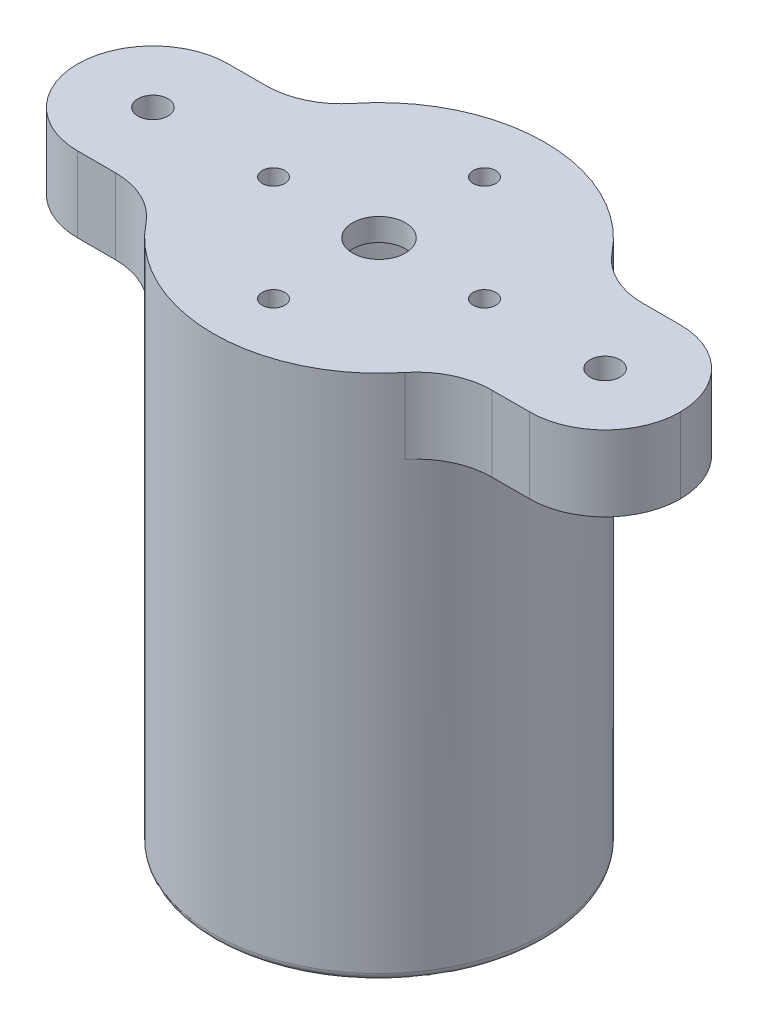
ISO-10303-21;
HEADER;
FILE_DESCRIPTION(('STEP AP214'),'2;1');
FILE_NAME('part.step','',(''),(''),'','','');
FILE_SCHEMA(('AUTOMOTIVE_DESIGN { 1 0 10303 214 1 1 1 1 }'));
ENDSEC;
DATA;
#1=APPLICATION_CONTEXT('core data for automotive mechanical design processes');
#2=APPLICATION_PROTOCOL_DEFINITION('international standard','automotive_design',2000,#1);
#3=PRODUCT_CONTEXT('',#1,'mechanical');
#4=PRODUCT('Part','Part','',(#3));
#5=PRODUCT_RELATED_PRODUCT_CATEGORY('part','',(#4));
#6=PRODUCT_DEFINITION_FORMATION('','',#4);
#7=PRODUCT_DEFINITION_CONTEXT('part definition',#1,'design');
#8=PRODUCT_DEFINITION('design','',#6,#7);
#9=PRODUCT_DEFINITION_SHAPE('','',#8);
#10=(LENGTH_UNIT() NAMED_UNIT(*) SI_UNIT(.MILLI.,.METRE.));
#11=(NAMED_UNIT(*) PLANE_ANGLE_UNIT() SI_UNIT($,.RADIAN.));
#12=(NAMED_UNIT(*) SI_UNIT($,.STERADIAN.) SOLID_ANGLE_UNIT());
#13=UNCERTAINTY_MEASURE_WITH_UNIT(LENGTH_MEASURE(1.E-05),#10,'distance_accuracy_value','');
#14=(GEOMETRIC_REPRESENTATION_CONTEXT(3) GLOBAL_UNCERTAINTY_ASSIGNED_CONTEXT((#13)) GLOBAL_UNIT_ASSIGNED_CONTEXT((#10,
#11,#12)) REPRESENTATION_CONTEXT('',''));
#15=CARTESIAN_POINT('',(0.,0.,0.));
#16=DIRECTION('',(0.,0.,1.));
#17=DIRECTION('',(1.,0.,0.));
#18=AXIS2_PLACEMENT_3D('',#15,#16,#17);
#19=CARTESIAN_POINT('',(0.,65.,0.));
#20=DIRECTION('',(0.,1.,0.));
#21=DIRECTION('',(0.,0.,1.));
#22=AXIS2_PLACEMENT_3D('',#19,#20,#21);
#23=CYLINDRICAL_SURFACE('',#22,3.5);
#24=CARTESIAN_POINT('',(0.,70.,0.));
#25=DIRECTION('',(0.,1.,0.));
#26=DIRECTION('',(0.,0.,1.));
#27=AXIS2_PLACEMENT_3D('',#24,#25,#26);
#28=CIRCLE('',#27,3.5);
#29=CARTESIAN_POINT('',(0.,70.,3.5));
#30=VERTEX_POINT('',#29);
#31=EDGE_CURVE('E258',#30,#30,#28,.T.);
#32=ORIENTED_EDGE('',*,*,#31,.T.);
#33=EDGE_LOOP('',(#32));
#34=FACE_BOUND('',#33,.T.);
#35=CARTESIAN_POINT('',(0.,67.,0.));
#36=DIRECTION('',(0.,-1.,0.));
#37=DIRECTION('',(0.,0.,-1.));
#38=AXIS2_PLACEMENT_3D('',#35,#36,#37);
#39=CIRCLE('',#38,3.5);
#40=CARTESIAN_POINT('',(0.,67.,-3.5));
#41=VERTEX_POINT('',#40);
#42=EDGE_CURVE('E42',#41,#41,#39,.F.);
#43=ORIENTED_EDGE('',*,*,#42,.F.);
#44=EDGE_LOOP('',(#43));
#45=FACE_BOUND('',#44,.T.);
#46=ADVANCED_FACE('F38',(#34,#45),#23,.F.);
#47=CARTESIAN_POINT('',(0.,70.,0.));
#48=DIRECTION('',(0.,-1.,0.));
#49=DIRECTION('',(0.,0.,-1.));
#50=AXIS2_PLACEMENT_3D('',#47,#48,#49);
#51=CYLINDRICAL_SURFACE('',#50,22.);
#52=CARTESIAN_POINT('',(0.,1.,0.));
#53=DIRECTION('',(0.,1.,0.));
#54=DIRECTION('',(0.,0.,1.));
#55=AXIS2_PLACEMENT_3D('',#52,#53,#54);
#56=CIRCLE('',#55,22.);
#57=CARTESIAN_POINT('',(0.,1.,22.));
#58=VERTEX_POINT('',#57);
#59=EDGE_CURVE('E11',#58,#58,#56,.T.);
#60=ORIENTED_EDGE('',*,*,#59,.T.);
#61=EDGE_LOOP('',(#60));
#62=FACE_BOUND('',#61,.T.);
#63=CARTESIAN_POINT('',(0.,70.,0.));
#64=DIRECTION('',(0.,1.,0.));
#65=DIRECTION('',(0.,0.,1.));
#66=AXIS2_PLACEMENT_3D('',#63,#64,#65);
#67=CIRCLE('',#66,22.);
#68=CARTESIAN_POINT('',(-17.1737444955956,70.,13.75));
#69=VERTEX_POINT('',#68);
#70=CARTESIAN_POINT('',(17.1737444955956,70.,13.75));
#71=VERTEX_POINT('',#70);
#72=EDGE_CURVE('E272',#69,#71,#67,.T.);
#73=ORIENTED_EDGE('',*,*,#72,.F.);
#74=DIRECTION('',(0.,-1.,0.));
#75=VECTOR('',#74,1.);
#76=CARTESIAN_POINT('',(-17.1737444955956,70.,13.75));
#77=LINE('',#76,#75);
#78=CARTESIAN_POINT('',(-17.1737444955956,60.,13.75));
#79=VERTEX_POINT('',#78);
#80=EDGE_CURVE('E202',#69,#79,#77,.T.);
#81=ORIENTED_EDGE('',*,*,#80,.T.);
#82=CARTESIAN_POINT('',(0.,60.,0.));
#83=DIRECTION('',(0.,1.,0.));
#84=DIRECTION('',(0.,0.,1.));
#85=AXIS2_PLACEMENT_3D('',#82,#83,#84);
#86=CIRCLE('',#85,22.);
#87=CARTESIAN_POINT('',(-17.1737444955956,60.,-13.75));
#88=VERTEX_POINT('',#87);
#89=EDGE_CURVE('E166',#88,#79,#86,.T.);
#90=ORIENTED_EDGE('',*,*,#89,.F.);
#91=DIRECTION('',(0.,-1.,0.));
#92=VECTOR('',#91,1.);
#93=CARTESIAN_POINT('',(-17.1737444955956,70.,-13.75));
#94=LINE('',#93,#92);
#95=CARTESIAN_POINT('',(-17.1737444955956,70.,-13.75));
#96=VERTEX_POINT('',#95);
#97=EDGE_CURVE('E199',#88,#96,#94,.F.);
#98=ORIENTED_EDGE('',*,*,#97,.T.);
#99=CARTESIAN_POINT('',(17.1737444955956,70.,-13.75));
#100=VERTEX_POINT('',#99);
#101=EDGE_CURVE('E275',#100,#96,#67,.T.);
#102=ORIENTED_EDGE('',*,*,#101,.F.);
#103=DIRECTION('',(0.,-1.,0.));
#104=VECTOR('',#103,1.);
#105=CARTESIAN_POINT('',(17.1737444955956,70.,-13.75));
#106=LINE('',#105,#104);
#107=CARTESIAN_POINT('',(17.1737444955956,60.,-13.75));
#108=VERTEX_POINT('',#107);
#109=EDGE_CURVE('E196',#100,#108,#106,.T.);
#110=ORIENTED_EDGE('',*,*,#109,.T.);
#111=CARTESIAN_POINT('',(17.1737444955956,60.,13.75));
#112=VERTEX_POINT('',#111);
#113=EDGE_CURVE('E162',#112,#108,#86,.T.);
#114=ORIENTED_EDGE('',*,*,#113,.F.);
#115=DIRECTION('',(0.,-1.,0.));
#116=VECTOR('',#115,1.);
#117=CARTESIAN_POINT('',(17.1737444955956,70.,13.75));
#118=LINE('',#117,#116);
#119=EDGE_CURVE('E191',#112,#71,#118,.F.);
#120=ORIENTED_EDGE('',*,*,#119,.T.);
#121=EDGE_LOOP('',(#73,#81,#90,#98,#102,#110,#114,#120));
#122=FACE_BOUND('',#121,.T.);
#123=ADVANCED_FACE('F281',(#62,#122),#51,.T.);
#124=CARTESIAN_POINT('',(0.,70.,0.));
#125=DIRECTION('',(0.,1.,0.));
#126=DIRECTION('',(0.,0.,1.));
#127=AXIS2_PLACEMENT_3D('',#124,#125,#126);
#128=PLANE('',#127);
#129=CARTESIAN_POINT('',(30.,70.,0.));
#130=DIRECTION('',(0.,1.,0.));
#131=DIRECTION('',(0.,0.,1.));
#132=AXIS2_PLACEMENT_3D('',#129,#130,#131);
#133=CIRCLE('',#132,2.);
#134=CARTESIAN_POINT('',(30.,70.,2.));
#135=VERTEX_POINT('',#134);
#136=EDGE_CURVE('E502',#135,#135,#133,.T.);
#137=ORIENTED_EDGE('',*,*,#136,.F.);
#138=EDGE_LOOP('',(#137));
#139=FACE_BOUND('',#138,.T.);
#140=CARTESIAN_POINT('',(-30.,70.,0.));
#141=DIRECTION('',(0.,1.,0.));
#142=DIRECTION('',(0.,0.,1.));
#143=AXIS2_PLACEMENT_3D('',#140,#141,#142);
#144=CIRCLE('',#143,2.);
#145=CARTESIAN_POINT('',(-30.,70.,2.));
#146=VERTEX_POINT('',#145);
#147=EDGE_CURVE('E176',#146,#146,#144,.T.);
#148=ORIENTED_EDGE('',*,*,#147,.F.);
#149=EDGE_LOOP('',(#148));
#150=FACE_BOUND('',#149,.T.);
#151=CARTESIAN_POINT('',(0.,70.,14.));
#152=DIRECTION('',(0.,1.,0.));
#153=DIRECTION('',(0.,0.,1.));
#154=AXIS2_PLACEMENT_3D('',#151,#152,#153);
#155=CIRCLE('',#154,1.5);
#156=CARTESIAN_POINT('',(0.,70.,15.5));
#157=VERTEX_POINT('',#156);
#158=EDGE_CURVE('E519',#157,#157,#155,.T.);
#159=ORIENTED_EDGE('',*,*,#158,.F.);
#160=EDGE_LOOP('',(#159));
#161=FACE_BOUND('',#160,.T.);
#162=CARTESIAN_POINT('',(0.,70.,-14.));
#163=DIRECTION('',(0.,1.,0.));
#164=DIRECTION('',(0.,0.,1.));
#165=AXIS2_PLACEMENT_3D('',#162,#163,#164);
#166=CIRCLE('',#165,1.5);
#167=CARTESIAN_POINT('',(0.,70.,-12.5));
#168=VERTEX_POINT('',#167);
#169=EDGE_CURVE('E491',#168,#168,#166,.T.);
#170=ORIENTED_EDGE('',*,*,#169,.F.);
#171=EDGE_LOOP('',(#170));
#172=FACE_BOUND('',#171,.T.);
#173=CARTESIAN_POINT('',(14.,70.,0.));
#174=DIRECTION('',(0.,1.,0.));
#175=DIRECTION('',(0.,0.,1.));
#176=AXIS2_PLACEMENT_3D('',#173,#174,#175);
#177=CIRCLE('',#176,1.5);
#178=CARTESIAN_POINT('',(14.,70.,1.5));
#179=VERTEX_POINT('',#178);
#180=EDGE_CURVE('E487',#179,#179,#177,.T.);
#181=ORIENTED_EDGE('',*,*,#180,.F.);
#182=EDGE_LOOP('',(#181));
#183=FACE_BOUND('',#182,.T.);
#184=CARTESIAN_POINT('',(-14.,70.,0.));
#185=DIRECTION('',(0.,1.,0.));
#186=DIRECTION('',(0.,0.,1.));
#187=AXIS2_PLACEMENT_3D('',#184,#185,#186);
#188=CIRCLE('',#187,1.5);
#189=CARTESIAN_POINT('',(-14.,70.,1.5));
#190=VERTEX_POINT('',#189);
#191=EDGE_CURVE('E494',#190,#190,#188,.T.);
#192=ORIENTED_EDGE('',*,*,#191,.F.);
#193=EDGE_LOOP('',(#192));
#194=FACE_BOUND('',#193,.T.);
#195=ORIENTED_EDGE('',*,*,#31,.F.);
#196=EDGE_LOOP('',(#195));
#197=FACE_BOUND('',#196,.T.);
#198=ORIENTED_EDGE('',*,*,#101,.T.);
#199=CARTESIAN_POINT('',(-24.9799919935936,70.,-20.));
#200=DIRECTION('',(0.,1.,0.));
#201=DIRECTION('',(0.,0.,1.));
#202=AXIS2_PLACEMENT_3D('',#199,#200,#201);
#203=CIRCLE('',#202,10.);
#204=CARTESIAN_POINT('',(-24.9799919935936,70.,-10.));
#205=VERTEX_POINT('',#204);
#206=EDGE_CURVE('E216',#96,#205,#203,.F.);
#207=ORIENTED_EDGE('',*,*,#206,.T.);
#208=DIRECTION('',(-1.,0.,0.));
#209=VECTOR('',#208,1.);
#210=CARTESIAN_POINT('',(-40.,70.,-10.));
#211=LINE('',#210,#209);
#212=CARTESIAN_POINT('',(-30.,70.,-10.));
#213=VERTEX_POINT('',#212);
#214=EDGE_CURVE('E257',#205,#213,#211,.T.);
#215=ORIENTED_EDGE('',*,*,#214,.T.);
#216=CARTESIAN_POINT('',(-30.,70.,0.));
#217=DIRECTION('',(0.,1.,0.));
#218=DIRECTION('',(0.,0.,1.));
#219=AXIS2_PLACEMENT_3D('',#216,#217,#218);
#220=CIRCLE('',#219,10.);
#221=CARTESIAN_POINT('',(-40.,70.,0.));
#222=VERTEX_POINT('',#221);
#223=EDGE_CURVE('E182',#213,#222,#220,.T.);
#224=ORIENTED_EDGE('',*,*,#223,.T.);
#225=CARTESIAN_POINT('',(-30.,70.,0.));
#226=DIRECTION('',(0.,1.,0.));
#227=DIRECTION('',(0.,0.,1.));
#228=AXIS2_PLACEMENT_3D('',#225,#226,#227);
#229=CIRCLE('',#228,10.);
#230=CARTESIAN_POINT('',(-30.,70.,10.));
#231=VERTEX_POINT('',#230);
#232=EDGE_CURVE('E180',#222,#231,#229,.T.);
#233=ORIENTED_EDGE('',*,*,#232,.T.);
#234=DIRECTION('',(1.,0.,0.));
#235=VECTOR('',#234,1.);
#236=CARTESIAN_POINT('',(-40.,70.,10.));
#237=LINE('',#236,#235);
#238=CARTESIAN_POINT('',(-24.9799919935936,70.,10.));
#239=VERTEX_POINT('',#238);
#240=EDGE_CURVE('E144',#231,#239,#237,.T.);
#241=ORIENTED_EDGE('',*,*,#240,.T.);
#242=CARTESIAN_POINT('',(-24.9799919935936,70.,20.));
#243=DIRECTION('',(0.,1.,0.));
#244=DIRECTION('',(0.,0.,1.));
#245=AXIS2_PLACEMENT_3D('',#242,#243,#244);
#246=CIRCLE('',#245,10.);
#247=EDGE_CURVE('E214',#239,#69,#246,.F.);
#248=ORIENTED_EDGE('',*,*,#247,.T.);
#249=ORIENTED_EDGE('',*,*,#72,.T.);
#250=CARTESIAN_POINT('',(24.9799919935936,70.,20.));
#251=DIRECTION('',(0.,1.,0.));
#252=DIRECTION('',(0.,0.,1.));
#253=AXIS2_PLACEMENT_3D('',#250,#251,#252);
#254=CIRCLE('',#253,10.);
#255=CARTESIAN_POINT('',(24.9799919935936,70.,10.));
#256=VERTEX_POINT('',#255);
#257=EDGE_CURVE('E54',#71,#256,#254,.F.);
#258=ORIENTED_EDGE('',*,*,#257,.T.);
#259=CARTESIAN_POINT('',(30.,70.,10.));
#260=VERTEX_POINT('',#259);
#261=EDGE_CURVE('E137',#256,#260,#237,.T.);
#262=ORIENTED_EDGE('',*,*,#261,.T.);
#263=CARTESIAN_POINT('',(30.,70.,0.));
#264=DIRECTION('',(0.,1.,0.));
#265=DIRECTION('',(0.,0.,1.));
#266=AXIS2_PLACEMENT_3D('',#263,#264,#265);
#267=CIRCLE('',#266,10.);
#268=CARTESIAN_POINT('',(40.,70.,0.));
#269=VERTEX_POINT('',#268);
#270=EDGE_CURVE('E142',#260,#269,#267,.T.);
#271=ORIENTED_EDGE('',*,*,#270,.T.);
#272=CARTESIAN_POINT('',(30.,70.,0.));
#273=DIRECTION('',(0.,1.,0.));
#274=DIRECTION('',(0.,0.,1.));
#275=AXIS2_PLACEMENT_3D('',#272,#273,#274);
#276=CIRCLE('',#275,10.);
#277=CARTESIAN_POINT('',(30.,70.,-10.));
#278=VERTEX_POINT('',#277);
#279=EDGE_CURVE('E161',#269,#278,#276,.T.);
#280=ORIENTED_EDGE('',*,*,#279,.T.);
#281=CARTESIAN_POINT('',(24.9799919935936,70.,-10.));
#282=VERTEX_POINT('',#281);
#283=EDGE_CURVE('E145',#278,#282,#211,.T.);
#284=ORIENTED_EDGE('',*,*,#283,.T.);
#285=CARTESIAN_POINT('',(24.9799919935936,70.,-20.));
#286=DIRECTION('',(0.,1.,0.));
#287=DIRECTION('',(0.,0.,1.));
#288=AXIS2_PLACEMENT_3D('',#285,#286,#287);
#289=CIRCLE('',#288,10.);
#290=EDGE_CURVE('E223',#282,#100,#289,.F.);
#291=ORIENTED_EDGE('',*,*,#290,.T.);
#292=EDGE_LOOP('',(#198,#207,#215,#224,#233,#241,#248,#249,#258,#262,#271,#280,#284,#291));
#293=FACE_BOUND('',#292,.T.);
#294=ADVANCED_FACE('F140',(#139,#150,#161,#172,#183,#194,#197,#293),#128,.T.);
#295=CARTESIAN_POINT('',(0.,0.,0.));
#296=DIRECTION('',(0.,1.,0.));
#297=DIRECTION('',(0.,0.,1.));
#298=AXIS2_PLACEMENT_3D('',#295,#296,#297);
#299=PLANE('',#298);
#300=CARTESIAN_POINT('',(0.,0.,0.));
#301=DIRECTION('',(0.,1.,0.));
#302=DIRECTION('',(0.,0.,1.));
#303=AXIS2_PLACEMENT_3D('',#300,#301,#302);
#304=CIRCLE('',#303,20.);
#305=CARTESIAN_POINT('',(0.,0.,20.));
#306=VERTEX_POINT('',#305);
#307=EDGE_CURVE('E47',#306,#306,#304,.T.);
#308=ORIENTED_EDGE('',*,*,#307,.T.);
#309=EDGE_LOOP('',(#308));
#310=FACE_BOUND('',#309,.T.);
#311=CARTESIAN_POINT('',(0.,0.,0.));
#312=DIRECTION('',(0.,1.,0.));
#313=DIRECTION('',(0.,0.,1.));
#314=AXIS2_PLACEMENT_3D('',#311,#312,#313);
#315=CIRCLE('',#314,21.);
#316=CARTESIAN_POINT('',(0.,0.,21.));
#317=VERTEX_POINT('',#316);
#318=EDGE_CURVE('E232',#317,#317,#315,.F.);
#319=ORIENTED_EDGE('',*,*,#318,.T.);
#320=EDGE_LOOP('',(#319));
#321=FACE_BOUND('',#320,.T.);
#322=ADVANCED_FACE('F238',(#310,#321),#299,.F.);
#323=CARTESIAN_POINT('',(0.,60.,0.));
#324=DIRECTION('',(0.,1.,0.));
#325=DIRECTION('',(0.,0.,1.));
#326=AXIS2_PLACEMENT_3D('',#323,#324,#325);
#327=PLANE('',#326);
#328=CARTESIAN_POINT('',(-30.,60.,0.));
#329=DIRECTION('',(0.,1.,0.));
#330=DIRECTION('',(0.,0.,1.));
#331=AXIS2_PLACEMENT_3D('',#328,#329,#330);
#332=CIRCLE('',#331,2.);
#333=CARTESIAN_POINT('',(-30.,60.,2.));
#334=VERTEX_POINT('',#333);
#335=EDGE_CURVE('E507',#334,#334,#332,.T.);
#336=ORIENTED_EDGE('',*,*,#335,.T.);
#337=EDGE_LOOP('',(#336));
#338=FACE_BOUND('',#337,.T.);
#339=CARTESIAN_POINT('',(-30.,60.,0.));
#340=DIRECTION('',(0.,1.,0.));
#341=DIRECTION('',(0.,0.,1.));
#342=AXIS2_PLACEMENT_3D('',#339,#340,#341);
#343=CIRCLE('',#342,10.);
#344=CARTESIAN_POINT('',(-30.,60.,10.));
#345=VERTEX_POINT('',#344);
#346=CARTESIAN_POINT('',(-40.,60.,0.));
#347=VERTEX_POINT('',#346);
#348=EDGE_CURVE('E184',#345,#347,#343,.F.);
#349=ORIENTED_EDGE('',*,*,#348,.T.);
#350=CARTESIAN_POINT('',(-30.,60.,0.));
#351=DIRECTION('',(0.,1.,0.));
#352=DIRECTION('',(0.,0.,1.));
#353=AXIS2_PLACEMENT_3D('',#350,#351,#352);
#354=CIRCLE('',#353,10.);
#355=CARTESIAN_POINT('',(-30.,60.,-10.));
#356=VERTEX_POINT('',#355);
#357=EDGE_CURVE('E186',#347,#356,#354,.F.);
#358=ORIENTED_EDGE('',*,*,#357,.T.);
#359=DIRECTION('',(-1.,0.,0.));
#360=VECTOR('',#359,1.);
#361=CARTESIAN_POINT('',(-40.,60.,-10.));
#362=LINE('',#361,#360);
#363=CARTESIAN_POINT('',(-24.9799919935936,60.,-10.));
#364=VERTEX_POINT('',#363);
#365=EDGE_CURVE('E269',#364,#356,#362,.T.);
#366=ORIENTED_EDGE('',*,*,#365,.F.);
#367=CARTESIAN_POINT('',(-24.9799919935936,60.,-20.));
#368=DIRECTION('',(0.,1.,0.));
#369=DIRECTION('',(0.,0.,1.));
#370=AXIS2_PLACEMENT_3D('',#367,#368,#369);
#371=CIRCLE('',#370,10.);
#372=EDGE_CURVE('E218',#364,#88,#371,.T.);
#373=ORIENTED_EDGE('',*,*,#372,.T.);
#374=ORIENTED_EDGE('',*,*,#89,.T.);
#375=CARTESIAN_POINT('',(-24.9799919935936,60.,20.));
#376=DIRECTION('',(0.,1.,0.));
#377=DIRECTION('',(0.,0.,1.));
#378=AXIS2_PLACEMENT_3D('',#375,#376,#377);
#379=CIRCLE('',#378,10.);
#380=CARTESIAN_POINT('',(-24.9799919935936,60.,10.));
#381=VERTEX_POINT('',#380);
#382=EDGE_CURVE('E212',#79,#381,#379,.T.);
#383=ORIENTED_EDGE('',*,*,#382,.T.);
#384=DIRECTION('',(1.,0.,0.));
#385=VECTOR('',#384,1.);
#386=CARTESIAN_POINT('',(-40.,60.,10.));
#387=LINE('',#386,#385);
#388=EDGE_CURVE('E270',#345,#381,#387,.T.);
#389=ORIENTED_EDGE('',*,*,#388,.F.);
#390=EDGE_LOOP('',(#349,#358,#366,#373,#374,#383,#389));
#391=FACE_BOUND('',#390,.T.);
#392=ADVANCED_FACE('F289',(#338,#391),#327,.F.);
#393=CARTESIAN_POINT('',(-40.,60.,-10.));
#394=DIRECTION('',(0.,0.,-1.));
#395=DIRECTION('',(-1.,0.,0.));
#396=AXIS2_PLACEMENT_3D('',#393,#394,#395);
#397=PLANE('',#396);
#398=ORIENTED_EDGE('',*,*,#214,.F.);
#399=DIRECTION('',(0.,-1.,0.));
#400=VECTOR('',#399,1.);
#401=CARTESIAN_POINT('',(-24.9799919935936,60.,-10.));
#402=LINE('',#401,#400);
#403=EDGE_CURVE('E207',#205,#364,#402,.T.);
#404=ORIENTED_EDGE('',*,*,#403,.T.);
#405=ORIENTED_EDGE('',*,*,#365,.T.);
#406=DIRECTION('',(0.,1.,0.));
#407=VECTOR('',#406,1.);
#408=CARTESIAN_POINT('',(-30.,60.,-10.));
#409=LINE('',#408,#407);
#410=EDGE_CURVE('E154',#356,#213,#409,.T.);
#411=ORIENTED_EDGE('',*,*,#410,.T.);
#412=EDGE_LOOP('',(#398,#404,#405,#411));
#413=FACE_BOUND('',#412,.T.);
#414=ADVANCED_FACE('F308',(#413),#397,.T.);
#415=CARTESIAN_POINT('',(-40.,60.,10.));
#416=DIRECTION('',(0.,0.,1.));
#417=DIRECTION('',(1.,0.,0.));
#418=AXIS2_PLACEMENT_3D('',#415,#416,#417);
#419=PLANE('',#418);
#420=ORIENTED_EDGE('',*,*,#388,.T.);
#421=DIRECTION('',(0.,-1.,0.));
#422=VECTOR('',#421,1.);
#423=CARTESIAN_POINT('',(-24.9799919935936,60.,10.));
#424=LINE('',#423,#422);
#425=EDGE_CURVE('E205',#381,#239,#424,.F.);
#426=ORIENTED_EDGE('',*,*,#425,.T.);
#427=ORIENTED_EDGE('',*,*,#240,.F.);
#428=DIRECTION('',(0.,1.,0.));
#429=VECTOR('',#428,1.);
#430=CARTESIAN_POINT('',(-30.,60.,10.));
#431=LINE('',#430,#429);
#432=EDGE_CURVE('E189',#231,#345,#431,.F.);
#433=ORIENTED_EDGE('',*,*,#432,.T.);
#434=EDGE_LOOP('',(#420,#426,#427,#433));
#435=FACE_BOUND('',#434,.T.);
#436=ADVANCED_FACE('F292',(#435),#419,.T.);
#437=CARTESIAN_POINT('',(30.,60.,0.));
#438=DIRECTION('',(0.,1.,0.));
#439=DIRECTION('',(0.,0.,1.));
#440=AXIS2_PLACEMENT_3D('',#437,#438,#439);
#441=CIRCLE('',#440,2.);
#442=CARTESIAN_POINT('',(30.,60.,2.));
#443=VERTEX_POINT('',#442);
#444=EDGE_CURVE('E498',#443,#443,#441,.T.);
#445=ORIENTED_EDGE('',*,*,#444,.T.);
#446=EDGE_LOOP('',(#445));
#447=FACE_BOUND('',#446,.T.);
#448=CARTESIAN_POINT('',(30.,60.,-10.));
#449=VERTEX_POINT('',#448);
#450=CARTESIAN_POINT('',(24.9799919935936,60.,-10.));
#451=VERTEX_POINT('',#450);
#452=EDGE_CURVE('E266',#449,#451,#362,.T.);
#453=ORIENTED_EDGE('',*,*,#452,.F.);
#454=CARTESIAN_POINT('',(30.,60.,0.));
#455=DIRECTION('',(0.,1.,0.));
#456=DIRECTION('',(0.,0.,1.));
#457=AXIS2_PLACEMENT_3D('',#454,#455,#456);
#458=CIRCLE('',#457,10.);
#459=CARTESIAN_POINT('',(40.,60.,0.));
#460=VERTEX_POINT('',#459);
#461=EDGE_CURVE('E155',#449,#460,#458,.F.);
#462=ORIENTED_EDGE('',*,*,#461,.T.);
#463=CARTESIAN_POINT('',(30.,60.,0.));
#464=DIRECTION('',(0.,1.,0.));
#465=DIRECTION('',(0.,0.,1.));
#466=AXIS2_PLACEMENT_3D('',#463,#464,#465);
#467=CIRCLE('',#466,10.);
#468=CARTESIAN_POINT('',(30.,60.,10.));
#469=VERTEX_POINT('',#468);
#470=EDGE_CURVE('E172',#460,#469,#467,.F.);
#471=ORIENTED_EDGE('',*,*,#470,.T.);
#472=CARTESIAN_POINT('',(24.9799919935936,60.,10.));
#473=VERTEX_POINT('',#472);
#474=EDGE_CURVE('E150',#473,#469,#387,.T.);
#475=ORIENTED_EDGE('',*,*,#474,.F.);
#476=CARTESIAN_POINT('',(24.9799919935936,60.,20.));
#477=DIRECTION('',(0.,1.,0.));
#478=DIRECTION('',(0.,0.,1.));
#479=AXIS2_PLACEMENT_3D('',#476,#477,#478);
#480=CIRCLE('',#479,10.);
#481=EDGE_CURVE('E226',#473,#112,#480,.T.);
#482=ORIENTED_EDGE('',*,*,#481,.T.);
#483=ORIENTED_EDGE('',*,*,#113,.T.);
#484=CARTESIAN_POINT('',(24.9799919935936,60.,-20.));
#485=DIRECTION('',(0.,1.,0.));
#486=DIRECTION('',(0.,0.,1.));
#487=AXIS2_PLACEMENT_3D('',#484,#485,#486);
#488=CIRCLE('',#487,10.);
#489=EDGE_CURVE('E221',#108,#451,#488,.T.);
#490=ORIENTED_EDGE('',*,*,#489,.T.);
#491=EDGE_LOOP('',(#453,#462,#471,#475,#482,#483,#490));
#492=FACE_BOUND('',#491,.T.);
#493=ADVANCED_FACE('F321',(#447,#492),#327,.F.);
#494=ORIENTED_EDGE('',*,*,#261,.F.);
#495=DIRECTION('',(0.,-1.,0.));
#496=VECTOR('',#495,1.);
#497=CARTESIAN_POINT('',(24.9799919935936,60.,10.));
#498=LINE('',#497,#496);
#499=EDGE_CURVE('E61',#256,#473,#498,.T.);
#500=ORIENTED_EDGE('',*,*,#499,.T.);
#501=ORIENTED_EDGE('',*,*,#474,.T.);
#502=DIRECTION('',(0.,1.,0.));
#503=VECTOR('',#502,1.);
#504=CARTESIAN_POINT('',(30.,60.,10.));
#505=LINE('',#504,#503);
#506=EDGE_CURVE('E148',#469,#260,#505,.T.);
#507=ORIENTED_EDGE('',*,*,#506,.T.);
#508=EDGE_LOOP('',(#494,#500,#501,#507));
#509=FACE_BOUND('',#508,.T.);
#510=ADVANCED_FACE('F149',(#509),#419,.T.);
#511=ORIENTED_EDGE('',*,*,#452,.T.);
#512=DIRECTION('',(0.,-1.,0.));
#513=VECTOR('',#512,1.);
#514=CARTESIAN_POINT('',(24.9799919935936,60.,-10.));
#515=LINE('',#514,#513);
#516=EDGE_CURVE('E209',#451,#282,#515,.F.);
#517=ORIENTED_EDGE('',*,*,#516,.T.);
#518=ORIENTED_EDGE('',*,*,#283,.F.);
#519=DIRECTION('',(0.,1.,0.));
#520=VECTOR('',#519,1.);
#521=CARTESIAN_POINT('',(30.,60.,-10.));
#522=LINE('',#521,#520);
#523=EDGE_CURVE('E164',#278,#449,#522,.F.);
#524=ORIENTED_EDGE('',*,*,#523,.T.);
#525=EDGE_LOOP('',(#511,#517,#518,#524));
#526=FACE_BOUND('',#525,.T.);
#527=ADVANCED_FACE('F251',(#526),#397,.T.);
#528=CARTESIAN_POINT('',(0.,65.,0.));
#529=DIRECTION('',(0.,-1.,0.));
#530=DIRECTION('',(0.,0.,-1.));
#531=AXIS2_PLACEMENT_3D('',#528,#529,#530);
#532=CYLINDRICAL_SURFACE('',#531,19.);
#533=CARTESIAN_POINT('',(0.,1.,0.));
#534=DIRECTION('',(0.,1.,0.));
#535=DIRECTION('',(0.,0.,1.));
#536=AXIS2_PLACEMENT_3D('',#533,#534,#535);
#537=CIRCLE('',#536,19.);
#538=CARTESIAN_POINT('',(0.,1.,19.));
#539=VERTEX_POINT('',#538);
#540=EDGE_CURVE('E229',#539,#539,#537,.F.);
#541=ORIENTED_EDGE('',*,*,#540,.T.);
#542=EDGE_LOOP('',(#541));
#543=FACE_BOUND('',#542,.T.);
#544=CARTESIAN_POINT('',(0.,65.,0.));
#545=DIRECTION('',(0.,-1.,0.));
#546=DIRECTION('',(0.,0.,-1.));
#547=AXIS2_PLACEMENT_3D('',#544,#545,#546);
#548=CIRCLE('',#547,19.);
#549=CARTESIAN_POINT('',(0.,65.,-19.));
#550=VERTEX_POINT('',#549);
#551=EDGE_CURVE('E255',#550,#550,#548,.T.);
#552=ORIENTED_EDGE('',*,*,#551,.F.);
#553=EDGE_LOOP('',(#552));
#554=FACE_BOUND('',#553,.T.);
#555=ADVANCED_FACE('F247',(#543,#554),#532,.F.);
#556=CARTESIAN_POINT('',(0.,65.,0.));
#557=DIRECTION('',(0.,-1.,0.));
#558=DIRECTION('',(0.,0.,-1.));
#559=AXIS2_PLACEMENT_3D('',#556,#557,#558);
#560=PLANE('',#559);
#561=CARTESIAN_POINT('',(0.,65.,0.));
#562=DIRECTION('',(0.,-1.,0.));
#563=DIRECTION('',(0.,0.,-1.));
#564=AXIS2_PLACEMENT_3D('',#561,#562,#563);
#565=CIRCLE('',#564,11.);
#566=CARTESIAN_POINT('',(0.,65.,-11.));
#567=VERTEX_POINT('',#566);
#568=EDGE_CURVE('E510',#567,#567,#565,.T.);
#569=ORIENTED_EDGE('',*,*,#568,.F.);
#570=EDGE_LOOP('',(#569));
#571=FACE_BOUND('',#570,.T.);
#572=CARTESIAN_POINT('',(0.,65.,14.));
#573=DIRECTION('',(0.,1.,0.));
#574=DIRECTION('',(0.,0.,1.));
#575=AXIS2_PLACEMENT_3D('',#572,#573,#574);
#576=CIRCLE('',#575,1.5);
#577=CARTESIAN_POINT('',(0.,65.,15.5));
#578=VERTEX_POINT('',#577);
#579=EDGE_CURVE('E262',#578,#578,#576,.T.);
#580=ORIENTED_EDGE('',*,*,#579,.T.);
#581=EDGE_LOOP('',(#580));
#582=FACE_BOUND('',#581,.T.);
#583=CARTESIAN_POINT('',(0.,65.,-14.));
#584=DIRECTION('',(0.,1.,0.));
#585=DIRECTION('',(0.,0.,1.));
#586=AXIS2_PLACEMENT_3D('',#583,#584,#585);
#587=CIRCLE('',#586,1.5);
#588=CARTESIAN_POINT('',(0.,65.,-12.5));
#589=VERTEX_POINT('',#588);
#590=EDGE_CURVE('E522',#589,#589,#587,.T.);
#591=ORIENTED_EDGE('',*,*,#590,.T.);
#592=EDGE_LOOP('',(#591));
#593=FACE_BOUND('',#592,.T.);
#594=CARTESIAN_POINT('',(14.,65.,0.));
#595=DIRECTION('',(0.,1.,0.));
#596=DIRECTION('',(0.,0.,1.));
#597=AXIS2_PLACEMENT_3D('',#594,#595,#596);
#598=CIRCLE('',#597,1.5);
#599=CARTESIAN_POINT('',(14.,65.,1.5));
#600=VERTEX_POINT('',#599);
#601=EDGE_CURVE('E484',#600,#600,#598,.T.);
#602=ORIENTED_EDGE('',*,*,#601,.T.);
#603=EDGE_LOOP('',(#602));
#604=FACE_BOUND('',#603,.T.);
#605=CARTESIAN_POINT('',(-14.,65.,0.));
#606=DIRECTION('',(0.,1.,0.));
#607=DIRECTION('',(0.,0.,1.));
#608=AXIS2_PLACEMENT_3D('',#605,#606,#607);
#609=CIRCLE('',#608,1.5);
#610=CARTESIAN_POINT('',(-14.,65.,1.5));
#611=VERTEX_POINT('',#610);
#612=EDGE_CURVE('E489',#611,#611,#609,.T.);
#613=ORIENTED_EDGE('',*,*,#612,.T.);
#614=EDGE_LOOP('',(#613));
#615=FACE_BOUND('',#614,.T.);
#616=ORIENTED_EDGE('',*,*,#551,.T.);
#617=EDGE_LOOP('',(#616));
#618=FACE_BOUND('',#617,.T.);
#619=ADVANCED_FACE('F250',(#571,#582,#593,#604,#615,#618),#560,.T.);
#620=CARTESIAN_POINT('',(-14.,65.,0.));
#621=DIRECTION('',(0.,1.,0.));
#622=DIRECTION('',(0.,0.,1.));
#623=AXIS2_PLACEMENT_3D('',#620,#621,#622);
#624=CYLINDRICAL_SURFACE('',#623,1.5);
#625=ORIENTED_EDGE('',*,*,#612,.F.);
#626=EDGE_LOOP('',(#625));
#627=FACE_BOUND('',#626,.T.);
#628=ORIENTED_EDGE('',*,*,#191,.T.);
#629=EDGE_LOOP('',(#628));
#630=FACE_BOUND('',#629,.T.);
#631=ADVANCED_FACE('F346',(#627,#630),#624,.F.);
#632=CARTESIAN_POINT('',(14.,65.,0.));
#633=DIRECTION('',(0.,1.,0.));
#634=DIRECTION('',(0.,0.,1.));
#635=AXIS2_PLACEMENT_3D('',#632,#633,#634);
#636=CYLINDRICAL_SURFACE('',#635,1.5);
#637=ORIENTED_EDGE('',*,*,#601,.F.);
#638=EDGE_LOOP('',(#637));
#639=FACE_BOUND('',#638,.T.);
#640=ORIENTED_EDGE('',*,*,#180,.T.);
#641=EDGE_LOOP('',(#640));
#642=FACE_BOUND('',#641,.T.);
#643=ADVANCED_FACE('F474',(#639,#642),#636,.F.);
#644=CARTESIAN_POINT('',(0.,65.,-14.));
#645=DIRECTION('',(0.,1.,0.));
#646=DIRECTION('',(0.,0.,1.));
#647=AXIS2_PLACEMENT_3D('',#644,#645,#646);
#648=CYLINDRICAL_SURFACE('',#647,1.5);
#649=ORIENTED_EDGE('',*,*,#590,.F.);
#650=EDGE_LOOP('',(#649));
#651=FACE_BOUND('',#650,.T.);
#652=ORIENTED_EDGE('',*,*,#169,.T.);
#653=EDGE_LOOP('',(#652));
#654=FACE_BOUND('',#653,.T.);
#655=ADVANCED_FACE('F471',(#651,#654),#648,.F.);
#656=CARTESIAN_POINT('',(0.,65.,14.));
#657=DIRECTION('',(0.,1.,0.));
#658=DIRECTION('',(0.,0.,1.));
#659=AXIS2_PLACEMENT_3D('',#656,#657,#658);
#660=CYLINDRICAL_SURFACE('',#659,1.5);
#661=ORIENTED_EDGE('',*,*,#579,.F.);
#662=EDGE_LOOP('',(#661));
#663=FACE_BOUND('',#662,.T.);
#664=ORIENTED_EDGE('',*,*,#158,.T.);
#665=EDGE_LOOP('',(#664));
#666=FACE_BOUND('',#665,.T.);
#667=ADVANCED_FACE('F464',(#663,#666),#660,.F.);
#668=CARTESIAN_POINT('',(30.,60.,0.));
#669=DIRECTION('',(0.,1.,0.));
#670=DIRECTION('',(0.,0.,1.));
#671=AXIS2_PLACEMENT_3D('',#668,#669,#670);
#672=CYLINDRICAL_SURFACE('',#671,2.);
#673=ORIENTED_EDGE('',*,*,#444,.F.);
#674=EDGE_LOOP('',(#673));
#675=FACE_BOUND('',#674,.T.);
#676=ORIENTED_EDGE('',*,*,#136,.T.);
#677=EDGE_LOOP('',(#676));
#678=FACE_BOUND('',#677,.T.);
#679=ADVANCED_FACE('F461',(#675,#678),#672,.F.);
#680=CARTESIAN_POINT('',(-30.,60.,0.));
#681=DIRECTION('',(0.,1.,0.));
#682=DIRECTION('',(0.,0.,1.));
#683=AXIS2_PLACEMENT_3D('',#680,#681,#682);
#684=CYLINDRICAL_SURFACE('',#683,2.);
#685=ORIENTED_EDGE('',*,*,#335,.F.);
#686=EDGE_LOOP('',(#685));
#687=FACE_BOUND('',#686,.T.);
#688=ORIENTED_EDGE('',*,*,#147,.T.);
#689=EDGE_LOOP('',(#688));
#690=FACE_BOUND('',#689,.T.);
#691=ADVANCED_FACE('F367',(#687,#690),#684,.F.);
#692=CARTESIAN_POINT('',(30.,60.,0.));
#693=DIRECTION('',(0.,1.,0.));
#694=DIRECTION('',(0.,0.,1.));
#695=AXIS2_PLACEMENT_3D('',#692,#693,#694);
#696=CYLINDRICAL_SURFACE('',#695,10.);
#697=ORIENTED_EDGE('',*,*,#506,.F.);
#698=ORIENTED_EDGE('',*,*,#470,.F.);
#699=DIRECTION('',(0.,1.,0.));
#700=VECTOR('',#699,1.);
#701=CARTESIAN_POINT('',(40.,60.,0.));
#702=LINE('',#701,#700);
#703=EDGE_CURVE('E159',#269,#460,#702,.F.);
#704=ORIENTED_EDGE('',*,*,#703,.F.);
#705=ORIENTED_EDGE('',*,*,#270,.F.);
#706=EDGE_LOOP('',(#697,#698,#704,#705));
#707=FACE_BOUND('',#706,.T.);
#708=ADVANCED_FACE('F157',(#707),#696,.T.);
#709=CARTESIAN_POINT('',(30.,60.,0.));
#710=DIRECTION('',(0.,1.,0.));
#711=DIRECTION('',(0.,0.,1.));
#712=AXIS2_PLACEMENT_3D('',#709,#710,#711);
#713=CYLINDRICAL_SURFACE('',#712,10.);
#714=ORIENTED_EDGE('',*,*,#461,.F.);
#715=ORIENTED_EDGE('',*,*,#523,.F.);
#716=ORIENTED_EDGE('',*,*,#279,.F.);
#717=ORIENTED_EDGE('',*,*,#703,.T.);
#718=EDGE_LOOP('',(#714,#715,#716,#717));
#719=FACE_BOUND('',#718,.T.);
#720=ADVANCED_FACE('F326',(#719),#713,.T.);
#721=CARTESIAN_POINT('',(-30.,60.,0.));
#722=DIRECTION('',(0.,1.,0.));
#723=DIRECTION('',(0.,0.,1.));
#724=AXIS2_PLACEMENT_3D('',#721,#722,#723);
#725=CYLINDRICAL_SURFACE('',#724,10.);
#726=DIRECTION('',(0.,1.,0.));
#727=VECTOR('',#726,1.);
#728=CARTESIAN_POINT('',(-40.,60.,0.));
#729=LINE('',#728,#727);
#730=EDGE_CURVE('E177',#347,#222,#729,.T.);
#731=ORIENTED_EDGE('',*,*,#730,.F.);
#732=ORIENTED_EDGE('',*,*,#348,.F.);
#733=ORIENTED_EDGE('',*,*,#432,.F.);
#734=ORIENTED_EDGE('',*,*,#232,.F.);
#735=EDGE_LOOP('',(#731,#732,#733,#734));
#736=FACE_BOUND('',#735,.T.);
#737=ADVANCED_FACE('F298',(#736),#725,.T.);
#738=CARTESIAN_POINT('',(-30.,60.,0.));
#739=DIRECTION('',(0.,1.,0.));
#740=DIRECTION('',(0.,0.,1.));
#741=AXIS2_PLACEMENT_3D('',#738,#739,#740);
#742=CYLINDRICAL_SURFACE('',#741,10.);
#743=ORIENTED_EDGE('',*,*,#357,.F.);
#744=ORIENTED_EDGE('',*,*,#730,.T.);
#745=ORIENTED_EDGE('',*,*,#223,.F.);
#746=ORIENTED_EDGE('',*,*,#410,.F.);
#747=EDGE_LOOP('',(#743,#744,#745,#746));
#748=FACE_BOUND('',#747,.T.);
#749=ADVANCED_FACE('F305',(#748),#742,.T.);
#750=CARTESIAN_POINT('',(-24.9799919935936,70.,20.));
#751=DIRECTION('',(0.,-1.,0.));
#752=DIRECTION('',(0.,0.,-1.));
#753=AXIS2_PLACEMENT_3D('',#750,#751,#752);
#754=CYLINDRICAL_SURFACE('',#753,10.);
#755=ORIENTED_EDGE('',*,*,#247,.F.);
#756=ORIENTED_EDGE('',*,*,#425,.F.);
#757=ORIENTED_EDGE('',*,*,#382,.F.);
#758=ORIENTED_EDGE('',*,*,#80,.F.);
#759=EDGE_LOOP('',(#755,#756,#757,#758));
#760=FACE_BOUND('',#759,.T.);
#761=ADVANCED_FACE('F285',(#760),#754,.F.);
#762=CARTESIAN_POINT('',(-24.9799919935936,70.,-20.));
#763=DIRECTION('',(0.,-1.,0.));
#764=DIRECTION('',(0.,0.,-1.));
#765=AXIS2_PLACEMENT_3D('',#762,#763,#764);
#766=CYLINDRICAL_SURFACE('',#765,10.);
#767=ORIENTED_EDGE('',*,*,#372,.F.);
#768=ORIENTED_EDGE('',*,*,#403,.F.);
#769=ORIENTED_EDGE('',*,*,#206,.F.);
#770=ORIENTED_EDGE('',*,*,#97,.F.);
#771=EDGE_LOOP('',(#767,#768,#769,#770));
#772=FACE_BOUND('',#771,.T.);
#773=ADVANCED_FACE('F311',(#772),#766,.F.);
#774=CARTESIAN_POINT('',(24.9799919935936,70.,-20.));
#775=DIRECTION('',(0.,-1.,0.));
#776=DIRECTION('',(0.,0.,-1.));
#777=AXIS2_PLACEMENT_3D('',#774,#775,#776);
#778=CYLINDRICAL_SURFACE('',#777,10.);
#779=ORIENTED_EDGE('',*,*,#290,.F.);
#780=ORIENTED_EDGE('',*,*,#516,.F.);
#781=ORIENTED_EDGE('',*,*,#489,.F.);
#782=ORIENTED_EDGE('',*,*,#109,.F.);
#783=EDGE_LOOP('',(#779,#780,#781,#782));
#784=FACE_BOUND('',#783,.T.);
#785=ADVANCED_FACE('F317',(#784),#778,.F.);
#786=CARTESIAN_POINT('',(24.9799919935936,70.,20.));
#787=DIRECTION('',(0.,-1.,0.));
#788=DIRECTION('',(0.,0.,-1.));
#789=AXIS2_PLACEMENT_3D('',#786,#787,#788);
#790=CYLINDRICAL_SURFACE('',#789,10.);
#791=ORIENTED_EDGE('',*,*,#481,.F.);
#792=ORIENTED_EDGE('',*,*,#499,.F.);
#793=ORIENTED_EDGE('',*,*,#257,.F.);
#794=ORIENTED_EDGE('',*,*,#119,.F.);
#795=EDGE_LOOP('',(#791,#792,#793,#794));
#796=FACE_BOUND('',#795,.T.);
#797=ADVANCED_FACE('F244',(#796),#790,.F.);
#798=CARTESIAN_POINT('',(0.,1.,0.));
#799=DIRECTION('',(0.,1.,0.));
#800=DIRECTION('',(0.,0.,1.));
#801=AXIS2_PLACEMENT_3D('',#798,#799,#800);
#802=TOROIDAL_SURFACE('',#801,20.,1.);
#803=ORIENTED_EDGE('',*,*,#307,.F.);
#804=EDGE_LOOP('',(#803));
#805=FACE_BOUND('',#804,.T.);
#806=ORIENTED_EDGE('',*,*,#540,.F.);
#807=EDGE_LOOP('',(#806));
#808=FACE_BOUND('',#807,.T.);
#809=ADVANCED_FACE('F241',(#805,#808),#802,.T.);
#810=CARTESIAN_POINT('',(0.,1.,0.));
#811=DIRECTION('',(0.,1.,0.));
#812=DIRECTION('',(0.,0.,1.));
#813=AXIS2_PLACEMENT_3D('',#810,#811,#812);
#814=TOROIDAL_SURFACE('',#813,21.,1.);
#815=ORIENTED_EDGE('',*,*,#318,.F.);
#816=EDGE_LOOP('',(#815));
#817=FACE_BOUND('',#816,.T.);
#818=ORIENTED_EDGE('',*,*,#59,.F.);
#819=EDGE_LOOP('',(#818));
#820=FACE_BOUND('',#819,.T.);
#821=ADVANCED_FACE('F40',(#817,#820),#814,.T.);
#822=CARTESIAN_POINT('',(0.,67.,0.));
#823=DIRECTION('',(0.,-1.,0.));
#824=DIRECTION('',(0.,0.,-1.));
#825=AXIS2_PLACEMENT_3D('',#822,#823,#824);
#826=PLANE('',#825);
#827=CARTESIAN_POINT('',(0.,67.,0.));
#828=DIRECTION('',(0.,-1.,0.));
#829=DIRECTION('',(0.,0.,-1.));
#830=AXIS2_PLACEMENT_3D('',#827,#828,#829);
#831=CIRCLE('',#830,11.);
#832=CARTESIAN_POINT('',(0.,67.,-11.));
#833=VERTEX_POINT('',#832);
#834=EDGE_CURVE('E546',#833,#833,#831,.T.);
#835=ORIENTED_EDGE('',*,*,#834,.T.);
#836=EDGE_LOOP('',(#835));
#837=FACE_BOUND('',#836,.T.);
#838=ORIENTED_EDGE('',*,*,#42,.T.);
#839=EDGE_LOOP('',(#838));
#840=FACE_BOUND('',#839,.T.);
#841=ADVANCED_FACE('F423',(#837,#840),#826,.T.);
#842=CARTESIAN_POINT('',(0.,67.,0.));
#843=DIRECTION('',(0.,-1.,0.));
#844=DIRECTION('',(0.,0.,-1.));
#845=AXIS2_PLACEMENT_3D('',#842,#843,#844);
#846=CYLINDRICAL_SURFACE('',#845,11.);
#847=ORIENTED_EDGE('',*,*,#834,.F.);
#848=EDGE_LOOP('',(#847));
#849=FACE_BOUND('',#848,.T.);
#850=ORIENTED_EDGE('',*,*,#568,.T.);
#851=EDGE_LOOP('',(#850));
#852=FACE_BOUND('',#851,.T.);
#853=ADVANCED_FACE('F444',(#849,#852),#846,.F.);
#854=CLOSED_SHELL('',(#46,#123,#294,#322,#392,#414,#436,#493,#510,#527,#555,#619,#631,#643,#655,
#667,#679,#691,#708,#720,#737,#749,#761,#773,#785,#797,#809,#821,#841,#853));
#855=MANIFOLD_SOLID_BREP('B2',#854);
#856=ADVANCED_BREP_SHAPE_REPRESENTATION('',(#18,#855),#14);
#857=SHAPE_DEFINITION_REPRESENTATION(#9,#856);
ENDSEC;
END-ISO-10303-21;
